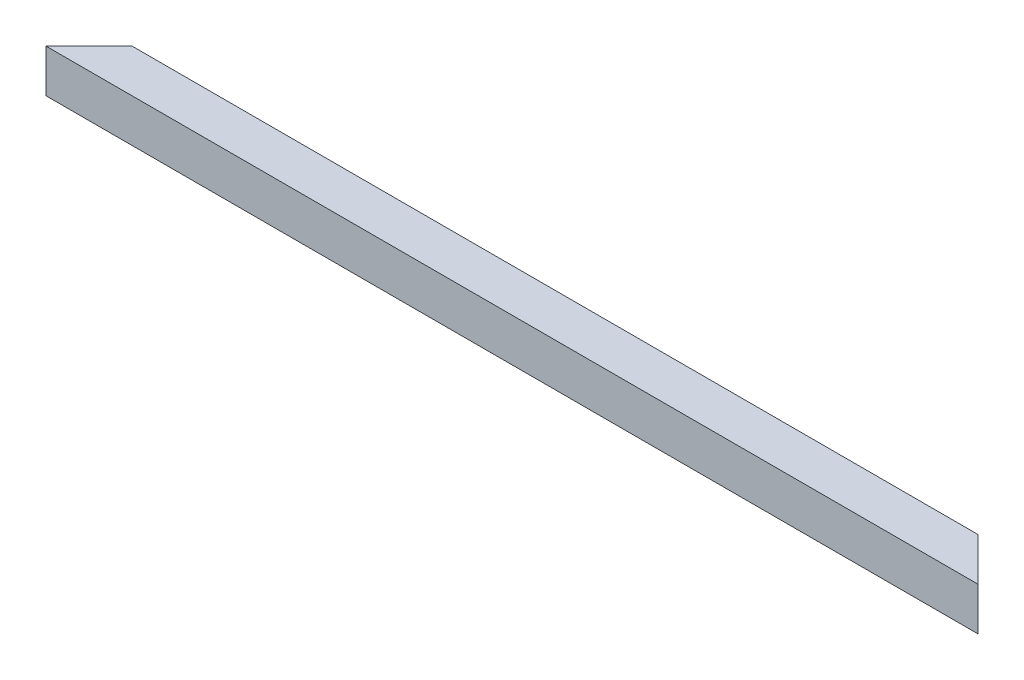
ISO-10303-21;
HEADER;
FILE_DESCRIPTION(('STEP AP214'),'2;1');
FILE_NAME('part.step','',(''),(''),'','','');
FILE_SCHEMA(('AUTOMOTIVE_DESIGN { 1 0 10303 214 1 1 1 1 }'));
ENDSEC;
DATA;
#1=APPLICATION_CONTEXT('core data for automotive mechanical design processes');
#2=APPLICATION_PROTOCOL_DEFINITION('international standard','automotive_design',2000,#1);
#3=PRODUCT_CONTEXT('',#1,'mechanical');
#4=PRODUCT('Part','Part','',(#3));
#5=PRODUCT_RELATED_PRODUCT_CATEGORY('part','',(#4));
#6=PRODUCT_DEFINITION_FORMATION('','',#4);
#7=PRODUCT_DEFINITION_CONTEXT('part definition',#1,'design');
#8=PRODUCT_DEFINITION('design','',#6,#7);
#9=PRODUCT_DEFINITION_SHAPE('','',#8);
#10=(LENGTH_UNIT() NAMED_UNIT(*) SI_UNIT(.MILLI.,.METRE.));
#11=(NAMED_UNIT(*) PLANE_ANGLE_UNIT() SI_UNIT($,.RADIAN.));
#12=(NAMED_UNIT(*) SI_UNIT($,.STERADIAN.) SOLID_ANGLE_UNIT());
#13=UNCERTAINTY_MEASURE_WITH_UNIT(LENGTH_MEASURE(1.E-05),#10,'distance_accuracy_value','');
#14=(GEOMETRIC_REPRESENTATION_CONTEXT(3) GLOBAL_UNCERTAINTY_ASSIGNED_CONTEXT((#13)) GLOBAL_UNIT_ASSIGNED_CONTEXT((#10,
#11,#12)) REPRESENTATION_CONTEXT('',''));
#15=CARTESIAN_POINT('',(0.,0.,0.));
#16=DIRECTION('',(0.,0.,1.));
#17=DIRECTION('',(1.,0.,0.));
#18=AXIS2_PLACEMENT_3D('',#15,#16,#17);
#19=CARTESIAN_POINT('',(0.,1.2,-1.2));
#20=DIRECTION('',(0.,-1.,0.));
#21=DIRECTION('',(0.,0.,-1.));
#22=AXIS2_PLACEMENT_3D('',#19,#20,#21);
#23=PLANE('',#22);
#24=DIRECTION('',(1.,0.,0.));
#25=VECTOR('',#24,1.);
#26=CARTESIAN_POINT('',(0.,1.2,-24.2));
#27=LINE('',#26,#25);
#28=CARTESIAN_POINT('',(24.1999999999999,1.2,-24.2));
#29=VERTEX_POINT('',#28);
#30=CARTESIAN_POINT('',(525.8,1.2,-24.2));
#31=VERTEX_POINT('',#30);
#32=EDGE_CURVE('E151',#29,#31,#27,.T.);
#33=ORIENTED_EDGE('',*,*,#32,.F.);
#34=DIRECTION('',(-0.707106781186546,0.,0.707106781186549));
#35=VECTOR('',#34,1.);
#36=CARTESIAN_POINT('',(0.600000000000001,1.2,-0.600000000000004));
#37=LINE('',#36,#35);
#38=CARTESIAN_POINT('',(1.2,1.2,-1.2));
#39=VERTEX_POINT('',#38);
#40=EDGE_CURVE('E11',#29,#39,#37,.T.);
#41=ORIENTED_EDGE('',*,*,#40,.T.);
#42=DIRECTION('',(1.,0.,0.));
#43=VECTOR('',#42,1.);
#44=CARTESIAN_POINT('',(0.,1.2,-1.2));
#45=LINE('',#44,#43);
#46=CARTESIAN_POINT('',(548.8,1.2,-1.20000000000003));
#47=VERTEX_POINT('',#46);
#48=EDGE_CURVE('E147',#39,#47,#45,.T.);
#49=ORIENTED_EDGE('',*,*,#48,.T.);
#50=DIRECTION('',(-0.707106781186552,0.,-0.707106781186543));
#51=VECTOR('',#50,1.);
#52=CARTESIAN_POINT('',(274.399999999997,1.2,-275.6));
#53=LINE('',#52,#51);
#54=EDGE_CURVE('E52',#47,#31,#53,.T.);
#55=ORIENTED_EDGE('',*,*,#54,.T.);
#56=EDGE_LOOP('',(#33,#41,#49,#55));
#57=FACE_BOUND('',#56,.T.);
#58=ADVANCED_FACE('F43',(#57),#23,.F.);
#59=CARTESIAN_POINT('',(0.,1.2,-24.2));
#60=DIRECTION('',(0.,0.,-1.));
#61=DIRECTION('',(-1.,0.,0.));
#62=AXIS2_PLACEMENT_3D('',#59,#60,#61);
#63=PLANE('',#62);
#64=DIRECTION('',(1.,0.,0.));
#65=VECTOR('',#64,1.);
#66=CARTESIAN_POINT('',(0.,24.2,-24.2));
#67=LINE('',#66,#65);
#68=CARTESIAN_POINT('',(24.1999999999999,24.2,-24.2));
#69=VERTEX_POINT('',#68);
#70=CARTESIAN_POINT('',(525.8,24.2,-24.2));
#71=VERTEX_POINT('',#70);
#72=EDGE_CURVE('E155',#69,#71,#67,.T.);
#73=ORIENTED_EDGE('',*,*,#72,.F.);
#74=DIRECTION('',(0.,-1.,0.));
#75=VECTOR('',#74,1.);
#76=CARTESIAN_POINT('',(24.1999999999999,1.2,-24.2));
#77=LINE('',#76,#75);
#78=EDGE_CURVE('E168',#69,#29,#77,.T.);
#79=ORIENTED_EDGE('',*,*,#78,.T.);
#80=ORIENTED_EDGE('',*,*,#32,.T.);
#81=DIRECTION('',(0.,1.,0.));
#82=VECTOR('',#81,1.);
#83=CARTESIAN_POINT('',(525.8,1.2,-24.2));
#84=LINE('',#83,#82);
#85=EDGE_CURVE('E180',#31,#71,#84,.T.);
#86=ORIENTED_EDGE('',*,*,#85,.T.);
#87=EDGE_LOOP('',(#73,#79,#80,#86));
#88=FACE_BOUND('',#87,.T.);
#89=ADVANCED_FACE('F212',(#88),#63,.F.);
#90=CARTESIAN_POINT('',(0.,24.2,-24.2));
#91=DIRECTION('',(0.,1.,0.));
#92=DIRECTION('',(0.,0.,1.));
#93=AXIS2_PLACEMENT_3D('',#90,#91,#92);
#94=PLANE('',#93);
#95=DIRECTION('',(1.,0.,0.));
#96=VECTOR('',#95,1.);
#97=CARTESIAN_POINT('',(0.,24.2,-1.2));
#98=LINE('',#97,#96);
#99=CARTESIAN_POINT('',(1.2,24.2,-1.2));
#100=VERTEX_POINT('',#99);
#101=CARTESIAN_POINT('',(548.8,24.2,-1.20000000000003));
#102=VERTEX_POINT('',#101);
#103=EDGE_CURVE('E126',#100,#102,#98,.T.);
#104=ORIENTED_EDGE('',*,*,#103,.F.);
#105=DIRECTION('',(0.707106781186546,0.,-0.707106781186549));
#106=VECTOR('',#105,1.);
#107=CARTESIAN_POINT('',(12.1,24.2,-12.1000000000001));
#108=LINE('',#107,#106);
#109=EDGE_CURVE('E164',#100,#69,#108,.T.);
#110=ORIENTED_EDGE('',*,*,#109,.T.);
#111=ORIENTED_EDGE('',*,*,#72,.T.);
#112=DIRECTION('',(0.707106781186552,0.,0.707106781186543));
#113=VECTOR('',#112,1.);
#114=CARTESIAN_POINT('',(262.899999999997,24.2,-287.1));
#115=LINE('',#114,#113);
#116=EDGE_CURVE('E176',#71,#102,#115,.T.);
#117=ORIENTED_EDGE('',*,*,#116,.T.);
#118=EDGE_LOOP('',(#104,#110,#111,#117));
#119=FACE_BOUND('',#118,.T.);
#120=ADVANCED_FACE('F214',(#119),#94,.F.);
#121=CARTESIAN_POINT('',(0.,24.2,-1.2));
#122=DIRECTION('',(0.,0.,1.));
#123=DIRECTION('',(0.,-1.,0.));
#124=AXIS2_PLACEMENT_3D('',#121,#122,#123);
#125=PLANE('',#124);
#126=ORIENTED_EDGE('',*,*,#48,.F.);
#127=DIRECTION('',(0.,1.,0.));
#128=VECTOR('',#127,1.);
#129=CARTESIAN_POINT('',(1.19999999999999,24.2,-1.2));
#130=LINE('',#129,#128);
#131=EDGE_CURVE('E67',#39,#100,#130,.T.);
#132=ORIENTED_EDGE('',*,*,#131,.T.);
#133=ORIENTED_EDGE('',*,*,#103,.T.);
#134=DIRECTION('',(0.,-1.,0.));
#135=VECTOR('',#134,1.);
#136=CARTESIAN_POINT('',(548.8,24.1999999999999,-1.2));
#137=LINE('',#136,#135);
#138=EDGE_CURVE('E172',#102,#47,#137,.T.);
#139=ORIENTED_EDGE('',*,*,#138,.T.);
#140=EDGE_LOOP('',(#126,#132,#133,#139));
#141=FACE_BOUND('',#140,.T.);
#142=ADVANCED_FACE('F206',(#141),#125,.F.);
#143=CARTESIAN_POINT('',(550.,0.,0.));
#144=DIRECTION('',(-0.707106781186543,0.,0.707106781186552));
#145=DIRECTION('',(0.707106781186552,0.,0.707106781186543));
#146=AXIS2_PLACEMENT_3D('',#143,#144,#145);
#147=PLANE('',#146);
#148=DIRECTION('',(0.707106781186552,0.,0.707106781186543));
#149=VECTOR('',#148,1.);
#150=CARTESIAN_POINT('',(550.,25.4,0.));
#151=LINE('',#150,#149);
#152=CARTESIAN_POINT('',(524.6,25.4,-25.4));
#153=VERTEX_POINT('',#152);
#154=CARTESIAN_POINT('',(550.,25.4,0.));
#155=VERTEX_POINT('',#154);
#156=EDGE_CURVE('E186',#153,#155,#151,.T.);
#157=ORIENTED_EDGE('',*,*,#156,.T.);
#158=DIRECTION('',(0.,-1.,0.));
#159=VECTOR('',#158,1.);
#160=CARTESIAN_POINT('',(550.,25.4,0.));
#161=LINE('',#160,#159);
#162=CARTESIAN_POINT('',(550.,0.,0.));
#163=VERTEX_POINT('',#162);
#164=EDGE_CURVE('E132',#155,#163,#161,.T.);
#165=ORIENTED_EDGE('',*,*,#164,.T.);
#166=DIRECTION('',(0.707106781186552,0.,0.707106781186543));
#167=VECTOR('',#166,1.);
#168=CARTESIAN_POINT('',(550.,0.,0.));
#169=LINE('',#168,#167);
#170=CARTESIAN_POINT('',(524.6,0.,-25.4));
#171=VERTEX_POINT('',#170);
#172=EDGE_CURVE('E121',#171,#163,#169,.T.);
#173=ORIENTED_EDGE('',*,*,#172,.F.);
#174=DIRECTION('',(0.,1.,0.));
#175=VECTOR('',#174,1.);
#176=CARTESIAN_POINT('',(524.6,0.,-25.4));
#177=LINE('',#176,#175);
#178=EDGE_CURVE('E187',#171,#153,#177,.T.);
#179=ORIENTED_EDGE('',*,*,#178,.T.);
#180=EDGE_LOOP('',(#157,#165,#173,#179));
#181=FACE_BOUND('',#180,.T.);
#182=ORIENTED_EDGE('',*,*,#116,.F.);
#183=ORIENTED_EDGE('',*,*,#85,.F.);
#184=ORIENTED_EDGE('',*,*,#54,.F.);
#185=ORIENTED_EDGE('',*,*,#138,.F.);
#186=EDGE_LOOP('',(#182,#183,#184,#185));
#187=FACE_BOUND('',#186,.T.);
#188=ADVANCED_FACE('F203',(#181,#187),#147,.F.);
#189=CARTESIAN_POINT('',(0.,0.,0.));
#190=DIRECTION('',(0.707106781186549,0.,0.707106781186546));
#191=DIRECTION('',(0.707106781186546,0.,-0.707106781186549));
#192=AXIS2_PLACEMENT_3D('',#189,#190,#191);
#193=PLANE('',#192);
#194=DIRECTION('',(0.707106781186546,0.,-0.707106781186549));
#195=VECTOR('',#194,1.);
#196=CARTESIAN_POINT('',(0.,25.4,0.));
#197=LINE('',#196,#195);
#198=CARTESIAN_POINT('',(0.,25.4,0.));
#199=VERTEX_POINT('',#198);
#200=CARTESIAN_POINT('',(25.3999999999998,25.4,-25.3999999999999));
#201=VERTEX_POINT('',#200);
#202=EDGE_CURVE('E115',#199,#201,#197,.T.);
#203=ORIENTED_EDGE('',*,*,#202,.T.);
#204=DIRECTION('',(0.,1.,0.));
#205=VECTOR('',#204,1.);
#206=CARTESIAN_POINT('',(25.3999999999998,0.,-25.3999999999999));
#207=LINE('',#206,#205);
#208=CARTESIAN_POINT('',(25.3999999999999,0.,-25.4));
#209=VERTEX_POINT('',#208);
#210=EDGE_CURVE('E59',#209,#201,#207,.T.);
#211=ORIENTED_EDGE('',*,*,#210,.F.);
#212=DIRECTION('',(0.707106781186546,0.,-0.707106781186549));
#213=VECTOR('',#212,1.);
#214=CARTESIAN_POINT('',(0.,0.,0.));
#215=LINE('',#214,#213);
#216=CARTESIAN_POINT('',(0.,0.,0.));
#217=VERTEX_POINT('',#216);
#218=EDGE_CURVE('E105',#217,#209,#215,.T.);
#219=ORIENTED_EDGE('',*,*,#218,.F.);
#220=DIRECTION('',(0.,-1.,0.));
#221=VECTOR('',#220,1.);
#222=CARTESIAN_POINT('',(0.,25.4,0.));
#223=LINE('',#222,#221);
#224=EDGE_CURVE('E109',#199,#217,#223,.T.);
#225=ORIENTED_EDGE('',*,*,#224,.F.);
#226=EDGE_LOOP('',(#203,#211,#219,#225));
#227=FACE_BOUND('',#226,.T.);
#228=ORIENTED_EDGE('',*,*,#40,.F.);
#229=ORIENTED_EDGE('',*,*,#78,.F.);
#230=ORIENTED_EDGE('',*,*,#109,.F.);
#231=ORIENTED_EDGE('',*,*,#131,.F.);
#232=EDGE_LOOP('',(#228,#229,#230,#231));
#233=FACE_BOUND('',#232,.T.);
#234=ADVANCED_FACE('F107',(#227,#233),#193,.F.);
#235=CARTESIAN_POINT('',(0.,25.4,0.));
#236=DIRECTION('',(0.,0.,-1.));
#237=DIRECTION('',(-1.,0.,0.));
#238=AXIS2_PLACEMENT_3D('',#235,#236,#237);
#239=PLANE('',#238);
#240=DIRECTION('',(1.,0.,0.));
#241=VECTOR('',#240,1.);
#242=CARTESIAN_POINT('',(0.,0.,0.));
#243=LINE('',#242,#241);
#244=EDGE_CURVE('E119',#217,#163,#243,.T.);
#245=ORIENTED_EDGE('',*,*,#244,.T.);
#246=ORIENTED_EDGE('',*,*,#164,.F.);
#247=DIRECTION('',(1.,0.,0.));
#248=VECTOR('',#247,1.);
#249=CARTESIAN_POINT('',(0.,25.4,0.));
#250=LINE('',#249,#248);
#251=EDGE_CURVE('E130',#199,#155,#250,.T.);
#252=ORIENTED_EDGE('',*,*,#251,.F.);
#253=ORIENTED_EDGE('',*,*,#224,.T.);
#254=EDGE_LOOP('',(#245,#246,#252,#253));
#255=FACE_BOUND('',#254,.T.);
#256=ADVANCED_FACE('F45',(#255),#239,.F.);
#257=CARTESIAN_POINT('',(550.,25.4,-25.4));
#258=DIRECTION('',(0.,0.,1.));
#259=DIRECTION('',(1.,0.,0.));
#260=AXIS2_PLACEMENT_3D('',#257,#258,#259);
#261=PLANE('',#260);
#262=DIRECTION('',(-1.,0.,0.));
#263=VECTOR('',#262,1.);
#264=CARTESIAN_POINT('',(550.,0.,-25.4));
#265=LINE('',#264,#263);
#266=EDGE_CURVE('E125',#171,#209,#265,.T.);
#267=ORIENTED_EDGE('',*,*,#266,.T.);
#268=ORIENTED_EDGE('',*,*,#210,.T.);
#269=DIRECTION('',(-1.,0.,0.));
#270=VECTOR('',#269,1.);
#271=CARTESIAN_POINT('',(550.,25.4,-25.4));
#272=LINE('',#271,#270);
#273=EDGE_CURVE('E137',#153,#201,#272,.T.);
#274=ORIENTED_EDGE('',*,*,#273,.F.);
#275=ORIENTED_EDGE('',*,*,#178,.F.);
#276=EDGE_LOOP('',(#267,#268,#274,#275));
#277=FACE_BOUND('',#276,.T.);
#278=ADVANCED_FACE('F198',(#277),#261,.F.);
#279=CARTESIAN_POINT('',(0.,25.4,0.));
#280=DIRECTION('',(0.,1.,0.));
#281=DIRECTION('',(0.,0.,1.));
#282=AXIS2_PLACEMENT_3D('',#279,#280,#281);
#283=PLANE('',#282);
#284=ORIENTED_EDGE('',*,*,#202,.F.);
#285=ORIENTED_EDGE('',*,*,#251,.T.);
#286=ORIENTED_EDGE('',*,*,#156,.F.);
#287=ORIENTED_EDGE('',*,*,#273,.T.);
#288=EDGE_LOOP('',(#284,#285,#286,#287));
#289=FACE_BOUND('',#288,.T.);
#290=ADVANCED_FACE('F201',(#289),#283,.T.);
#291=CARTESIAN_POINT('',(0.,0.,0.));
#292=DIRECTION('',(0.,1.,0.));
#293=DIRECTION('',(0.,0.,1.));
#294=AXIS2_PLACEMENT_3D('',#291,#292,#293);
#295=PLANE('',#294);
#296=ORIENTED_EDGE('',*,*,#244,.F.);
#297=ORIENTED_EDGE('',*,*,#218,.T.);
#298=ORIENTED_EDGE('',*,*,#266,.F.);
#299=ORIENTED_EDGE('',*,*,#172,.T.);
#300=EDGE_LOOP('',(#296,#297,#298,#299));
#301=FACE_BOUND('',#300,.T.);
#302=ADVANCED_FACE('F120',(#301),#295,.F.);
#303=CLOSED_SHELL('',(#58,#89,#120,#142,#188,#234,#256,#278,#290,#302));
#304=MANIFOLD_SOLID_BREP('B2',#303);
#305=ADVANCED_BREP_SHAPE_REPRESENTATION('',(#18,#304),#14);
#306=SHAPE_DEFINITION_REPRESENTATION(#9,#305);
ENDSEC;
END-ISO-10303-21;
